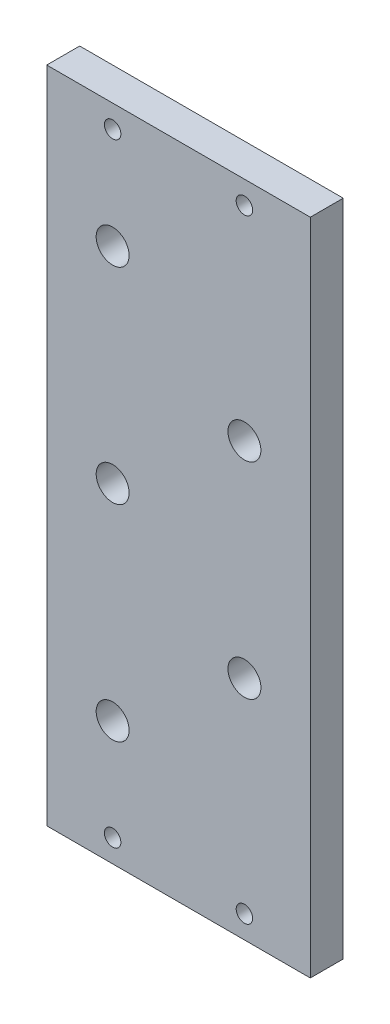
ISO-10303-21;
HEADER;
FILE_DESCRIPTION(('STEP AP214'),'2;1');
FILE_NAME('part.step','',(''),(''),'','','');
FILE_SCHEMA(('AUTOMOTIVE_DESIGN { 1 0 10303 214 1 1 1 1 }'));
ENDSEC;
DATA;
#1=APPLICATION_CONTEXT('core data for automotive mechanical design processes');
#2=APPLICATION_PROTOCOL_DEFINITION('international standard','automotive_design',2000,#1);
#3=PRODUCT_CONTEXT('',#1,'mechanical');
#4=PRODUCT('Part','Part','',(#3));
#5=PRODUCT_RELATED_PRODUCT_CATEGORY('part','',(#4));
#6=PRODUCT_DEFINITION_FORMATION('','',#4);
#7=PRODUCT_DEFINITION_CONTEXT('part definition',#1,'design');
#8=PRODUCT_DEFINITION('design','',#6,#7);
#9=PRODUCT_DEFINITION_SHAPE('','',#8);
#10=(LENGTH_UNIT() NAMED_UNIT(*) SI_UNIT(.MILLI.,.METRE.));
#11=(NAMED_UNIT(*) PLANE_ANGLE_UNIT() SI_UNIT($,.RADIAN.));
#12=(NAMED_UNIT(*) SI_UNIT($,.STERADIAN.) SOLID_ANGLE_UNIT());
#13=UNCERTAINTY_MEASURE_WITH_UNIT(LENGTH_MEASURE(1.E-05),#10,'distance_accuracy_value','');
#14=(GEOMETRIC_REPRESENTATION_CONTEXT(3) GLOBAL_UNCERTAINTY_ASSIGNED_CONTEXT((#13)) GLOBAL_UNIT_ASSIGNED_CONTEXT((#10,
#11,#12)) REPRESENTATION_CONTEXT('',''));
#15=CARTESIAN_POINT('',(0.,0.,0.));
#16=DIRECTION('',(0.,0.,1.));
#17=DIRECTION('',(1.,0.,0.));
#18=AXIS2_PLACEMENT_3D('',#15,#16,#17);
#19=CARTESIAN_POINT('',(0.,0.,12.7));
#20=DIRECTION('',(1.,0.,0.));
#21=DIRECTION('',(0.,0.,-1.));
#22=AXIS2_PLACEMENT_3D('',#19,#20,#21);
#23=PLANE('',#22);
#24=DIRECTION('',(0.,-1.,0.));
#25=VECTOR('',#24,1.);
#26=CARTESIAN_POINT('',(0.,0.,0.));
#27=LINE('',#26,#25);
#28=CARTESIAN_POINT('',(0.,254.,0.));
#29=VERTEX_POINT('',#28);
#30=CARTESIAN_POINT('',(0.,0.,0.));
#31=VERTEX_POINT('',#30);
#32=EDGE_CURVE('E96',#29,#31,#27,.T.);
#33=ORIENTED_EDGE('',*,*,#32,.T.);
#34=DIRECTION('',(0.,0.,-1.));
#35=VECTOR('',#34,1.);
#36=CARTESIAN_POINT('',(0.,0.,12.7));
#37=LINE('',#36,#35);
#38=CARTESIAN_POINT('',(0.,0.,12.7));
#39=VERTEX_POINT('',#38);
#40=EDGE_CURVE('E11',#39,#31,#37,.T.);
#41=ORIENTED_EDGE('',*,*,#40,.F.);
#42=DIRECTION('',(0.,-1.,0.));
#43=VECTOR('',#42,1.);
#44=CARTESIAN_POINT('',(0.,0.,12.7));
#45=LINE('',#44,#43);
#46=CARTESIAN_POINT('',(0.,254.,12.7));
#47=VERTEX_POINT('',#46);
#48=EDGE_CURVE('E84',#47,#39,#45,.T.);
#49=ORIENTED_EDGE('',*,*,#48,.F.);
#50=DIRECTION('',(0.,0.,-1.));
#51=VECTOR('',#50,1.);
#52=CARTESIAN_POINT('',(0.,254.,12.7));
#53=LINE('',#52,#51);
#54=EDGE_CURVE('E92',#47,#29,#53,.T.);
#55=ORIENTED_EDGE('',*,*,#54,.T.);
#56=EDGE_LOOP('',(#33,#41,#49,#55));
#57=FACE_BOUND('',#56,.T.);
#58=ADVANCED_FACE('F33',(#57),#23,.F.);
#59=CARTESIAN_POINT('',(0.,0.,12.7));
#60=DIRECTION('',(0.,1.,0.));
#61=DIRECTION('',(0.,0.,1.));
#62=AXIS2_PLACEMENT_3D('',#59,#60,#61);
#63=PLANE('',#62);
#64=DIRECTION('',(1.,0.,0.));
#65=VECTOR('',#64,1.);
#66=CARTESIAN_POINT('',(0.,0.,0.));
#67=LINE('',#66,#65);
#68=CARTESIAN_POINT('',(101.6,0.,0.));
#69=VERTEX_POINT('',#68);
#70=EDGE_CURVE('E88',#31,#69,#67,.T.);
#71=ORIENTED_EDGE('',*,*,#70,.T.);
#72=DIRECTION('',(0.,0.,-1.));
#73=VECTOR('',#72,1.);
#74=CARTESIAN_POINT('',(101.6,0.,12.7));
#75=LINE('',#74,#73);
#76=CARTESIAN_POINT('',(101.6,0.,12.7));
#77=VERTEX_POINT('',#76);
#78=EDGE_CURVE('E41',#77,#69,#75,.T.);
#79=ORIENTED_EDGE('',*,*,#78,.F.);
#80=DIRECTION('',(1.,0.,0.));
#81=VECTOR('',#80,1.);
#82=CARTESIAN_POINT('',(0.,0.,12.7));
#83=LINE('',#82,#81);
#84=EDGE_CURVE('E79',#39,#77,#83,.T.);
#85=ORIENTED_EDGE('',*,*,#84,.F.);
#86=ORIENTED_EDGE('',*,*,#40,.T.);
#87=EDGE_LOOP('',(#71,#79,#85,#86));
#88=FACE_BOUND('',#87,.T.);
#89=ADVANCED_FACE('F87',(#88),#63,.F.);
#90=CARTESIAN_POINT('',(101.6,0.,12.7));
#91=DIRECTION('',(-1.,0.,0.));
#92=DIRECTION('',(0.,0.,1.));
#93=AXIS2_PLACEMENT_3D('',#90,#91,#92);
#94=PLANE('',#93);
#95=DIRECTION('',(0.,1.,0.));
#96=VECTOR('',#95,1.);
#97=CARTESIAN_POINT('',(101.6,0.,0.));
#98=LINE('',#97,#96);
#99=CARTESIAN_POINT('',(101.6,254.,0.));
#100=VERTEX_POINT('',#99);
#101=EDGE_CURVE('E66',#69,#100,#98,.T.);
#102=ORIENTED_EDGE('',*,*,#101,.T.);
#103=DIRECTION('',(0.,0.,-1.));
#104=VECTOR('',#103,1.);
#105=CARTESIAN_POINT('',(101.6,254.,12.7));
#106=LINE('',#105,#104);
#107=CARTESIAN_POINT('',(101.6,254.,12.7));
#108=VERTEX_POINT('',#107);
#109=EDGE_CURVE('E89',#108,#100,#106,.T.);
#110=ORIENTED_EDGE('',*,*,#109,.F.);
#111=DIRECTION('',(0.,1.,0.));
#112=VECTOR('',#111,1.);
#113=CARTESIAN_POINT('',(101.6,0.,12.7));
#114=LINE('',#113,#112);
#115=EDGE_CURVE('E82',#77,#108,#114,.T.);
#116=ORIENTED_EDGE('',*,*,#115,.F.);
#117=ORIENTED_EDGE('',*,*,#78,.T.);
#118=EDGE_LOOP('',(#102,#110,#116,#117));
#119=FACE_BOUND('',#118,.T.);
#120=ADVANCED_FACE('F90',(#119),#94,.F.);
#121=CARTESIAN_POINT('',(0.,254.,12.7));
#122=DIRECTION('',(0.,-1.,0.));
#123=DIRECTION('',(0.,0.,-1.));
#124=AXIS2_PLACEMENT_3D('',#121,#122,#123);
#125=PLANE('',#124);
#126=DIRECTION('',(-1.,0.,0.));
#127=VECTOR('',#126,1.);
#128=CARTESIAN_POINT('',(0.,254.,0.));
#129=LINE('',#128,#127);
#130=EDGE_CURVE('E72',#100,#29,#129,.T.);
#131=ORIENTED_EDGE('',*,*,#130,.T.);
#132=ORIENTED_EDGE('',*,*,#54,.F.);
#133=DIRECTION('',(-1.,0.,0.));
#134=VECTOR('',#133,1.);
#135=CARTESIAN_POINT('',(0.,254.,12.7));
#136=LINE('',#135,#134);
#137=EDGE_CURVE('E49',#108,#47,#136,.T.);
#138=ORIENTED_EDGE('',*,*,#137,.F.);
#139=ORIENTED_EDGE('',*,*,#109,.T.);
#140=EDGE_LOOP('',(#131,#132,#138,#139));
#141=FACE_BOUND('',#140,.T.);
#142=ADVANCED_FACE('F104',(#141),#125,.F.);
#143=CARTESIAN_POINT('',(0.,254.,12.7));
#144=DIRECTION('',(0.,0.,-1.));
#145=DIRECTION('',(-1.,0.,0.));
#146=AXIS2_PLACEMENT_3D('',#143,#144,#145);
#147=PLANE('',#146);
#148=CARTESIAN_POINT('',(76.2,245.237,12.7));
#149=DIRECTION('',(0.,0.,1.));
#150=DIRECTION('',(1.,0.,0.));
#151=AXIS2_PLACEMENT_3D('',#148,#149,#150);
#152=CIRCLE('',#151,3.175);
#153=CARTESIAN_POINT('',(79.375,245.237,12.7));
#154=VERTEX_POINT('',#153);
#155=EDGE_CURVE('E158',#154,#154,#152,.T.);
#156=ORIENTED_EDGE('',*,*,#155,.F.);
#157=EDGE_LOOP('',(#156));
#158=FACE_BOUND('',#157,.T.);
#159=CARTESIAN_POINT('',(25.4,245.237,12.7));
#160=DIRECTION('',(0.,0.,1.));
#161=DIRECTION('',(1.,0.,0.));
#162=AXIS2_PLACEMENT_3D('',#159,#160,#161);
#163=CIRCLE('',#162,3.175);
#164=CARTESIAN_POINT('',(28.575,245.237,12.7));
#165=VERTEX_POINT('',#164);
#166=EDGE_CURVE('E152',#165,#165,#163,.T.);
#167=ORIENTED_EDGE('',*,*,#166,.F.);
#168=EDGE_LOOP('',(#167));
#169=FACE_BOUND('',#168,.T.);
#170=CARTESIAN_POINT('',(76.2,8.763,12.7));
#171=DIRECTION('',(0.,0.,1.));
#172=DIRECTION('',(1.,0.,0.));
#173=AXIS2_PLACEMENT_3D('',#170,#171,#172);
#174=CIRCLE('',#173,3.175);
#175=CARTESIAN_POINT('',(79.375,8.763,12.7));
#176=VERTEX_POINT('',#175);
#177=EDGE_CURVE('E146',#176,#176,#174,.T.);
#178=ORIENTED_EDGE('',*,*,#177,.F.);
#179=EDGE_LOOP('',(#178));
#180=FACE_BOUND('',#179,.T.);
#181=CARTESIAN_POINT('',(25.4,8.763,12.7));
#182=DIRECTION('',(0.,0.,1.));
#183=DIRECTION('',(1.,0.,0.));
#184=AXIS2_PLACEMENT_3D('',#181,#182,#183);
#185=CIRCLE('',#184,3.175);
#186=CARTESIAN_POINT('',(28.575,8.763,12.7));
#187=VERTEX_POINT('',#186);
#188=EDGE_CURVE('E140',#187,#187,#185,.T.);
#189=ORIENTED_EDGE('',*,*,#188,.F.);
#190=EDGE_LOOP('',(#189));
#191=FACE_BOUND('',#190,.T.);
#192=CARTESIAN_POINT('',(25.4,206.248,12.7));
#193=DIRECTION('',(0.,0.,1.));
#194=DIRECTION('',(1.,0.,0.));
#195=AXIS2_PLACEMENT_3D('',#192,#193,#194);
#196=CIRCLE('',#195,6.35);
#197=CARTESIAN_POINT('',(31.75,206.248,12.7));
#198=VERTEX_POINT('',#197);
#199=EDGE_CURVE('E134',#198,#198,#196,.T.);
#200=ORIENTED_EDGE('',*,*,#199,.F.);
#201=EDGE_LOOP('',(#200));
#202=FACE_BOUND('',#201,.T.);
#203=CARTESIAN_POINT('',(76.2,166.624,12.7));
#204=DIRECTION('',(0.,0.,1.));
#205=DIRECTION('',(1.,0.,0.));
#206=AXIS2_PLACEMENT_3D('',#203,#204,#205);
#207=CIRCLE('',#206,6.34999999999999);
#208=CARTESIAN_POINT('',(82.55,166.624,12.7));
#209=VERTEX_POINT('',#208);
#210=EDGE_CURVE('E128',#209,#209,#207,.T.);
#211=ORIENTED_EDGE('',*,*,#210,.F.);
#212=EDGE_LOOP('',(#211));
#213=FACE_BOUND('',#212,.T.);
#214=CARTESIAN_POINT('',(25.4,127.,12.7));
#215=DIRECTION('',(0.,0.,1.));
#216=DIRECTION('',(1.,0.,0.));
#217=AXIS2_PLACEMENT_3D('',#214,#215,#216);
#218=CIRCLE('',#217,6.35);
#219=CARTESIAN_POINT('',(31.75,127.,12.7));
#220=VERTEX_POINT('',#219);
#221=EDGE_CURVE('E122',#220,#220,#218,.T.);
#222=ORIENTED_EDGE('',*,*,#221,.F.);
#223=EDGE_LOOP('',(#222));
#224=FACE_BOUND('',#223,.T.);
#225=CARTESIAN_POINT('',(76.2,87.376,12.7));
#226=DIRECTION('',(0.,0.,1.));
#227=DIRECTION('',(1.,0.,0.));
#228=AXIS2_PLACEMENT_3D('',#225,#226,#227);
#229=CIRCLE('',#228,6.34999999999999);
#230=CARTESIAN_POINT('',(82.55,87.376,12.7));
#231=VERTEX_POINT('',#230);
#232=EDGE_CURVE('E116',#231,#231,#229,.T.);
#233=ORIENTED_EDGE('',*,*,#232,.F.);
#234=EDGE_LOOP('',(#233));
#235=FACE_BOUND('',#234,.T.);
#236=CARTESIAN_POINT('',(25.4,47.752,12.7));
#237=DIRECTION('',(0.,0.,1.));
#238=DIRECTION('',(1.,0.,0.));
#239=AXIS2_PLACEMENT_3D('',#236,#237,#238);
#240=CIRCLE('',#239,6.35);
#241=CARTESIAN_POINT('',(31.75,47.752,12.7));
#242=VERTEX_POINT('',#241);
#243=EDGE_CURVE('E110',#242,#242,#240,.T.);
#244=ORIENTED_EDGE('',*,*,#243,.F.);
#245=EDGE_LOOP('',(#244));
#246=FACE_BOUND('',#245,.T.);
#247=ORIENTED_EDGE('',*,*,#48,.T.);
#248=ORIENTED_EDGE('',*,*,#84,.T.);
#249=ORIENTED_EDGE('',*,*,#115,.T.);
#250=ORIENTED_EDGE('',*,*,#137,.T.);
#251=EDGE_LOOP('',(#247,#248,#249,#250));
#252=FACE_BOUND('',#251,.T.);
#253=ADVANCED_FACE('F80',(#158,#169,#180,#191,#202,#213,#224,#235,#246,#252),#147,.F.);
#254=CARTESIAN_POINT('',(0.,254.,0.));
#255=DIRECTION('',(0.,0.,-1.));
#256=DIRECTION('',(-1.,0.,0.));
#257=AXIS2_PLACEMENT_3D('',#254,#255,#256);
#258=PLANE('',#257);
#259=CARTESIAN_POINT('',(76.2,245.237,0.));
#260=DIRECTION('',(0.,0.,1.));
#261=DIRECTION('',(1.,0.,0.));
#262=AXIS2_PLACEMENT_3D('',#259,#260,#261);
#263=CIRCLE('',#262,3.175);
#264=CARTESIAN_POINT('',(79.375,245.237,0.));
#265=VERTEX_POINT('',#264);
#266=EDGE_CURVE('E155',#265,#265,#263,.T.);
#267=ORIENTED_EDGE('',*,*,#266,.T.);
#268=EDGE_LOOP('',(#267));
#269=FACE_BOUND('',#268,.T.);
#270=CARTESIAN_POINT('',(25.4,245.237,0.));
#271=DIRECTION('',(0.,0.,1.));
#272=DIRECTION('',(1.,0.,0.));
#273=AXIS2_PLACEMENT_3D('',#270,#271,#272);
#274=CIRCLE('',#273,3.175);
#275=CARTESIAN_POINT('',(28.575,245.237,0.));
#276=VERTEX_POINT('',#275);
#277=EDGE_CURVE('E149',#276,#276,#274,.T.);
#278=ORIENTED_EDGE('',*,*,#277,.T.);
#279=EDGE_LOOP('',(#278));
#280=FACE_BOUND('',#279,.T.);
#281=CARTESIAN_POINT('',(76.2,8.763,0.));
#282=DIRECTION('',(0.,0.,1.));
#283=DIRECTION('',(1.,0.,0.));
#284=AXIS2_PLACEMENT_3D('',#281,#282,#283);
#285=CIRCLE('',#284,3.175);
#286=CARTESIAN_POINT('',(79.375,8.763,0.));
#287=VERTEX_POINT('',#286);
#288=EDGE_CURVE('E143',#287,#287,#285,.T.);
#289=ORIENTED_EDGE('',*,*,#288,.T.);
#290=EDGE_LOOP('',(#289));
#291=FACE_BOUND('',#290,.T.);
#292=CARTESIAN_POINT('',(25.4,8.763,0.));
#293=DIRECTION('',(0.,0.,1.));
#294=DIRECTION('',(1.,0.,0.));
#295=AXIS2_PLACEMENT_3D('',#292,#293,#294);
#296=CIRCLE('',#295,3.175);
#297=CARTESIAN_POINT('',(28.575,8.763,0.));
#298=VERTEX_POINT('',#297);
#299=EDGE_CURVE('E137',#298,#298,#296,.T.);
#300=ORIENTED_EDGE('',*,*,#299,.T.);
#301=EDGE_LOOP('',(#300));
#302=FACE_BOUND('',#301,.T.);
#303=CARTESIAN_POINT('',(25.4,206.248,0.));
#304=DIRECTION('',(0.,0.,1.));
#305=DIRECTION('',(1.,0.,0.));
#306=AXIS2_PLACEMENT_3D('',#303,#304,#305);
#307=CIRCLE('',#306,6.35);
#308=CARTESIAN_POINT('',(31.75,206.248,0.));
#309=VERTEX_POINT('',#308);
#310=EDGE_CURVE('E131',#309,#309,#307,.T.);
#311=ORIENTED_EDGE('',*,*,#310,.T.);
#312=EDGE_LOOP('',(#311));
#313=FACE_BOUND('',#312,.T.);
#314=CARTESIAN_POINT('',(76.2,166.624,0.));
#315=DIRECTION('',(0.,0.,1.));
#316=DIRECTION('',(1.,0.,0.));
#317=AXIS2_PLACEMENT_3D('',#314,#315,#316);
#318=CIRCLE('',#317,6.34999999999999);
#319=CARTESIAN_POINT('',(82.55,166.624,0.));
#320=VERTEX_POINT('',#319);
#321=EDGE_CURVE('E125',#320,#320,#318,.T.);
#322=ORIENTED_EDGE('',*,*,#321,.T.);
#323=EDGE_LOOP('',(#322));
#324=FACE_BOUND('',#323,.T.);
#325=CARTESIAN_POINT('',(25.4,127.,0.));
#326=DIRECTION('',(0.,0.,1.));
#327=DIRECTION('',(1.,0.,0.));
#328=AXIS2_PLACEMENT_3D('',#325,#326,#327);
#329=CIRCLE('',#328,6.35);
#330=CARTESIAN_POINT('',(31.75,127.,0.));
#331=VERTEX_POINT('',#330);
#332=EDGE_CURVE('E119',#331,#331,#329,.T.);
#333=ORIENTED_EDGE('',*,*,#332,.T.);
#334=EDGE_LOOP('',(#333));
#335=FACE_BOUND('',#334,.T.);
#336=CARTESIAN_POINT('',(76.2,87.376,0.));
#337=DIRECTION('',(0.,0.,1.));
#338=DIRECTION('',(1.,0.,0.));
#339=AXIS2_PLACEMENT_3D('',#336,#337,#338);
#340=CIRCLE('',#339,6.34999999999999);
#341=CARTESIAN_POINT('',(82.55,87.376,0.));
#342=VERTEX_POINT('',#341);
#343=EDGE_CURVE('E113',#342,#342,#340,.T.);
#344=ORIENTED_EDGE('',*,*,#343,.T.);
#345=EDGE_LOOP('',(#344));
#346=FACE_BOUND('',#345,.T.);
#347=CARTESIAN_POINT('',(25.4,47.752,0.));
#348=DIRECTION('',(0.,0.,1.));
#349=DIRECTION('',(1.,0.,0.));
#350=AXIS2_PLACEMENT_3D('',#347,#348,#349);
#351=CIRCLE('',#350,6.35);
#352=CARTESIAN_POINT('',(31.75,47.752,0.));
#353=VERTEX_POINT('',#352);
#354=EDGE_CURVE('E99',#353,#353,#351,.T.);
#355=ORIENTED_EDGE('',*,*,#354,.T.);
#356=EDGE_LOOP('',(#355));
#357=FACE_BOUND('',#356,.T.);
#358=ORIENTED_EDGE('',*,*,#32,.F.);
#359=ORIENTED_EDGE('',*,*,#130,.F.);
#360=ORIENTED_EDGE('',*,*,#101,.F.);
#361=ORIENTED_EDGE('',*,*,#70,.F.);
#362=EDGE_LOOP('',(#358,#359,#360,#361));
#363=FACE_BOUND('',#362,.T.);
#364=ADVANCED_FACE('F107',(#269,#280,#291,#302,#313,#324,#335,#346,#357,#363),#258,.T.);
#365=CARTESIAN_POINT('',(25.4,47.752,0.));
#366=DIRECTION('',(0.,0.,1.));
#367=DIRECTION('',(1.,0.,0.));
#368=AXIS2_PLACEMENT_3D('',#365,#366,#367);
#369=CYLINDRICAL_SURFACE('',#368,6.35);
#370=ORIENTED_EDGE('',*,*,#354,.F.);
#371=EDGE_LOOP('',(#370));
#372=FACE_BOUND('',#371,.T.);
#373=ORIENTED_EDGE('',*,*,#243,.T.);
#374=EDGE_LOOP('',(#373));
#375=FACE_BOUND('',#374,.T.);
#376=ADVANCED_FACE('F192',(#372,#375),#369,.F.);
#377=CARTESIAN_POINT('',(76.2,87.376,0.));
#378=DIRECTION('',(0.,0.,1.));
#379=DIRECTION('',(1.,0.,0.));
#380=AXIS2_PLACEMENT_3D('',#377,#378,#379);
#381=CYLINDRICAL_SURFACE('',#380,6.34999999999999);
#382=ORIENTED_EDGE('',*,*,#343,.F.);
#383=EDGE_LOOP('',(#382));
#384=FACE_BOUND('',#383,.T.);
#385=ORIENTED_EDGE('',*,*,#232,.T.);
#386=EDGE_LOOP('',(#385));
#387=FACE_BOUND('',#386,.T.);
#388=ADVANCED_FACE('F194',(#384,#387),#381,.F.);
#389=CARTESIAN_POINT('',(25.4,127.,0.));
#390=DIRECTION('',(0.,0.,1.));
#391=DIRECTION('',(1.,0.,0.));
#392=AXIS2_PLACEMENT_3D('',#389,#390,#391);
#393=CYLINDRICAL_SURFACE('',#392,6.35);
#394=ORIENTED_EDGE('',*,*,#332,.F.);
#395=EDGE_LOOP('',(#394));
#396=FACE_BOUND('',#395,.T.);
#397=ORIENTED_EDGE('',*,*,#221,.T.);
#398=EDGE_LOOP('',(#397));
#399=FACE_BOUND('',#398,.T.);
#400=ADVANCED_FACE('F201',(#396,#399),#393,.F.);
#401=CARTESIAN_POINT('',(76.2,166.624,0.));
#402=DIRECTION('',(0.,0.,1.));
#403=DIRECTION('',(1.,0.,0.));
#404=AXIS2_PLACEMENT_3D('',#401,#402,#403);
#405=CYLINDRICAL_SURFACE('',#404,6.34999999999999);
#406=ORIENTED_EDGE('',*,*,#321,.F.);
#407=EDGE_LOOP('',(#406));
#408=FACE_BOUND('',#407,.T.);
#409=ORIENTED_EDGE('',*,*,#210,.T.);
#410=EDGE_LOOP('',(#409));
#411=FACE_BOUND('',#410,.T.);
#412=ADVANCED_FACE('F247',(#408,#411),#405,.F.);
#413=CARTESIAN_POINT('',(25.4,206.248,0.));
#414=DIRECTION('',(0.,0.,1.));
#415=DIRECTION('',(1.,0.,0.));
#416=AXIS2_PLACEMENT_3D('',#413,#414,#415);
#417=CYLINDRICAL_SURFACE('',#416,6.35);
#418=ORIENTED_EDGE('',*,*,#310,.F.);
#419=EDGE_LOOP('',(#418));
#420=FACE_BOUND('',#419,.T.);
#421=ORIENTED_EDGE('',*,*,#199,.T.);
#422=EDGE_LOOP('',(#421));
#423=FACE_BOUND('',#422,.T.);
#424=ADVANCED_FACE('F257',(#420,#423),#417,.F.);
#425=CARTESIAN_POINT('',(25.4,8.763,0.));
#426=DIRECTION('',(0.,0.,1.));
#427=DIRECTION('',(1.,0.,0.));
#428=AXIS2_PLACEMENT_3D('',#425,#426,#427);
#429=CYLINDRICAL_SURFACE('',#428,3.175);
#430=ORIENTED_EDGE('',*,*,#299,.F.);
#431=EDGE_LOOP('',(#430));
#432=FACE_BOUND('',#431,.T.);
#433=ORIENTED_EDGE('',*,*,#188,.T.);
#434=EDGE_LOOP('',(#433));
#435=FACE_BOUND('',#434,.T.);
#436=ADVANCED_FACE('F267',(#432,#435),#429,.F.);
#437=CARTESIAN_POINT('',(76.2,8.763,0.));
#438=DIRECTION('',(0.,0.,1.));
#439=DIRECTION('',(1.,0.,0.));
#440=AXIS2_PLACEMENT_3D('',#437,#438,#439);
#441=CYLINDRICAL_SURFACE('',#440,3.175);
#442=ORIENTED_EDGE('',*,*,#288,.F.);
#443=EDGE_LOOP('',(#442));
#444=FACE_BOUND('',#443,.T.);
#445=ORIENTED_EDGE('',*,*,#177,.T.);
#446=EDGE_LOOP('',(#445));
#447=FACE_BOUND('',#446,.T.);
#448=ADVANCED_FACE('F277',(#444,#447),#441,.F.);
#449=CARTESIAN_POINT('',(25.4,245.237,0.));
#450=DIRECTION('',(0.,0.,1.));
#451=DIRECTION('',(1.,0.,0.));
#452=AXIS2_PLACEMENT_3D('',#449,#450,#451);
#453=CYLINDRICAL_SURFACE('',#452,3.175);
#454=ORIENTED_EDGE('',*,*,#277,.F.);
#455=EDGE_LOOP('',(#454));
#456=FACE_BOUND('',#455,.T.);
#457=ORIENTED_EDGE('',*,*,#166,.T.);
#458=EDGE_LOOP('',(#457));
#459=FACE_BOUND('',#458,.T.);
#460=ADVANCED_FACE('F169',(#456,#459),#453,.F.);
#461=CARTESIAN_POINT('',(76.2,245.237,0.));
#462=DIRECTION('',(0.,0.,1.));
#463=DIRECTION('',(1.,0.,0.));
#464=AXIS2_PLACEMENT_3D('',#461,#462,#463);
#465=CYLINDRICAL_SURFACE('',#464,3.175);
#466=ORIENTED_EDGE('',*,*,#266,.F.);
#467=EDGE_LOOP('',(#466));
#468=FACE_BOUND('',#467,.T.);
#469=ORIENTED_EDGE('',*,*,#155,.T.);
#470=EDGE_LOOP('',(#469));
#471=FACE_BOUND('',#470,.T.);
#472=ADVANCED_FACE('F166',(#468,#471),#465,.F.);
#473=CLOSED_SHELL('',(#58,#89,#120,#142,#253,#364,#376,#388,#400,#412,#424,#436,#448,#460,#472));
#474=MANIFOLD_SOLID_BREP('B2',#473);
#475=ADVANCED_BREP_SHAPE_REPRESENTATION('',(#18,#474),#14);
#476=SHAPE_DEFINITION_REPRESENTATION(#9,#475);
ENDSEC;
END-ISO-10303-21;
